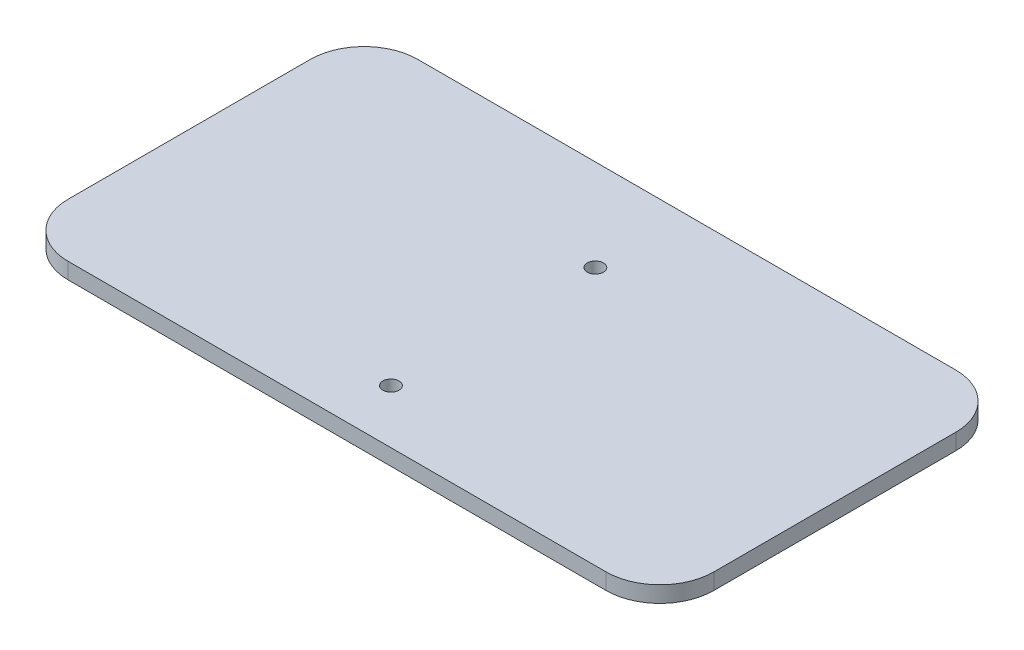
ISO-10303-21;
HEADER;
FILE_DESCRIPTION(('STEP AP214'),'2;1');
FILE_NAME('part.step','',(''),(''),'','','');
FILE_SCHEMA(('AUTOMOTIVE_DESIGN { 1 0 10303 214 1 1 1 1 }'));
ENDSEC;
DATA;
#1=APPLICATION_CONTEXT('core data for automotive mechanical design processes');
#2=APPLICATION_PROTOCOL_DEFINITION('international standard','automotive_design',2000,#1);
#3=PRODUCT_CONTEXT('',#1,'mechanical');
#4=PRODUCT('Part','Part','',(#3));
#5=PRODUCT_RELATED_PRODUCT_CATEGORY('part','',(#4));
#6=PRODUCT_DEFINITION_FORMATION('','',#4);
#7=PRODUCT_DEFINITION_CONTEXT('part definition',#1,'design');
#8=PRODUCT_DEFINITION('design','',#6,#7);
#9=PRODUCT_DEFINITION_SHAPE('','',#8);
#10=(LENGTH_UNIT() NAMED_UNIT(*) SI_UNIT(.MILLI.,.METRE.));
#11=(NAMED_UNIT(*) PLANE_ANGLE_UNIT() SI_UNIT($,.RADIAN.));
#12=(NAMED_UNIT(*) SI_UNIT($,.STERADIAN.) SOLID_ANGLE_UNIT());
#13=UNCERTAINTY_MEASURE_WITH_UNIT(LENGTH_MEASURE(1.E-05),#10,'distance_accuracy_value','');
#14=(GEOMETRIC_REPRESENTATION_CONTEXT(3) GLOBAL_UNCERTAINTY_ASSIGNED_CONTEXT((#13)) GLOBAL_UNIT_ASSIGNED_CONTEXT((#10,
#11,#12)) REPRESENTATION_CONTEXT('',''));
#15=CARTESIAN_POINT('',(0.,0.,0.));
#16=DIRECTION('',(0.,0.,1.));
#17=DIRECTION('',(1.,0.,0.));
#18=AXIS2_PLACEMENT_3D('',#15,#16,#17);
#19=CARTESIAN_POINT('',(-50.,3.,-45.));
#20=DIRECTION('',(0.,-1.,0.));
#21=DIRECTION('',(0.,0.,-1.));
#22=AXIS2_PLACEMENT_3D('',#19,#20,#21);
#23=PLANE('',#22);
#24=CARTESIAN_POINT('',(-50.,3.,-45.));
#25=DIRECTION('',(0.,1.,0.));
#26=DIRECTION('',(0.,0.,-1.));
#27=AXIS2_PLACEMENT_3D('',#24,#25,#26);
#28=CIRCLE('',#27,10.);
#29=CARTESIAN_POINT('',(-50.,3.,-55.));
#30=VERTEX_POINT('',#29);
#31=CARTESIAN_POINT('',(-60.,3.,-45.));
#32=VERTEX_POINT('',#31);
#33=EDGE_CURVE('E145',#30,#32,#28,.T.);
#34=ORIENTED_EDGE('',*,*,#33,.T.);
#35=DIRECTION('',(0.,0.,1.));
#36=VECTOR('',#35,1.);
#37=CARTESIAN_POINT('',(-60.,3.,0.));
#38=LINE('',#37,#36);
#39=CARTESIAN_POINT('',(-60.,3.,0.));
#40=VERTEX_POINT('',#39);
#41=EDGE_CURVE('E93',#32,#40,#38,.T.);
#42=ORIENTED_EDGE('',*,*,#41,.T.);
#43=CARTESIAN_POINT('',(-50.,3.,0.));
#44=DIRECTION('',(0.,1.,0.));
#45=DIRECTION('',(0.,0.,-1.));
#46=AXIS2_PLACEMENT_3D('',#43,#44,#45);
#47=CIRCLE('',#46,10.);
#48=CARTESIAN_POINT('',(-49.9999999999999,3.,10.));
#49=VERTEX_POINT('',#48);
#50=EDGE_CURVE('E160',#40,#49,#47,.T.);
#51=ORIENTED_EDGE('',*,*,#50,.T.);
#52=DIRECTION('',(1.,0.,0.));
#53=VECTOR('',#52,1.);
#54=CARTESIAN_POINT('',(-49.9999999999999,3.,10.));
#55=LINE('',#54,#53);
#56=CARTESIAN_POINT('',(49.9999999999999,3.,10.));
#57=VERTEX_POINT('',#56);
#58=EDGE_CURVE('E173',#49,#57,#55,.T.);
#59=ORIENTED_EDGE('',*,*,#58,.T.);
#60=CARTESIAN_POINT('',(50.,3.,0.));
#61=DIRECTION('',(0.,1.,0.));
#62=DIRECTION('',(0.,0.,1.));
#63=AXIS2_PLACEMENT_3D('',#60,#61,#62);
#64=CIRCLE('',#63,10.);
#65=CARTESIAN_POINT('',(60.,3.,0.));
#66=VERTEX_POINT('',#65);
#67=EDGE_CURVE('E112',#57,#66,#64,.T.);
#68=ORIENTED_EDGE('',*,*,#67,.T.);
#69=DIRECTION('',(0.,0.,-1.));
#70=VECTOR('',#69,1.);
#71=CARTESIAN_POINT('',(60.,3.,0.));
#72=LINE('',#71,#70);
#73=CARTESIAN_POINT('',(60.,3.,-45.));
#74=VERTEX_POINT('',#73);
#75=EDGE_CURVE('E106',#66,#74,#72,.T.);
#76=ORIENTED_EDGE('',*,*,#75,.T.);
#77=CARTESIAN_POINT('',(50.,3.,-45.));
#78=DIRECTION('',(0.,1.,0.));
#79=DIRECTION('',(0.,0.,-1.));
#80=AXIS2_PLACEMENT_3D('',#77,#78,#79);
#81=CIRCLE('',#80,10.);
#82=CARTESIAN_POINT('',(50.,3.,-55.));
#83=VERTEX_POINT('',#82);
#84=EDGE_CURVE('E110',#74,#83,#81,.T.);
#85=ORIENTED_EDGE('',*,*,#84,.T.);
#86=DIRECTION('',(-1.,0.,0.));
#87=VECTOR('',#86,1.);
#88=CARTESIAN_POINT('',(-50.,3.,-55.));
#89=LINE('',#88,#87);
#90=EDGE_CURVE('E50',#83,#30,#89,.T.);
#91=ORIENTED_EDGE('',*,*,#90,.T.);
#92=EDGE_LOOP('',(#34,#42,#51,#59,#68,#76,#85,#91));
#93=FACE_BOUND('',#92,.T.);
#94=CARTESIAN_POINT('',(0.,3.,0.));
#95=DIRECTION('',(0.,1.,0.));
#96=DIRECTION('',(0.,0.,1.));
#97=AXIS2_PLACEMENT_3D('',#94,#95,#96);
#98=CIRCLE('',#97,1.5);
#99=CARTESIAN_POINT('',(0.,3.,1.5));
#100=VERTEX_POINT('',#99);
#101=EDGE_CURVE('E134',#100,#100,#98,.T.);
#102=ORIENTED_EDGE('',*,*,#101,.F.);
#103=EDGE_LOOP('',(#102));
#104=FACE_BOUND('',#103,.T.);
#105=CARTESIAN_POINT('',(0.,3.,-38.));
#106=DIRECTION('',(0.,1.,0.));
#107=DIRECTION('',(0.,0.,1.));
#108=AXIS2_PLACEMENT_3D('',#105,#106,#107);
#109=CIRCLE('',#108,1.5);
#110=CARTESIAN_POINT('',(0.,3.,-36.5));
#111=VERTEX_POINT('',#110);
#112=EDGE_CURVE('E182',#111,#111,#109,.T.);
#113=ORIENTED_EDGE('',*,*,#112,.F.);
#114=EDGE_LOOP('',(#113));
#115=FACE_BOUND('',#114,.T.);
#116=ADVANCED_FACE('F33',(#93,#104,#115),#23,.F.);
#117=CARTESIAN_POINT('',(-50.,0.,-45.));
#118=DIRECTION('',(0.,-1.,0.));
#119=DIRECTION('',(0.,0.,-1.));
#120=AXIS2_PLACEMENT_3D('',#117,#118,#119);
#121=PLANE('',#120);
#122=CARTESIAN_POINT('',(0.,0.,0.));
#123=DIRECTION('',(0.,1.,0.));
#124=DIRECTION('',(0.,0.,1.));
#125=AXIS2_PLACEMENT_3D('',#122,#123,#124);
#126=CIRCLE('',#125,1.5);
#127=CARTESIAN_POINT('',(0.,0.,1.5));
#128=VERTEX_POINT('',#127);
#129=EDGE_CURVE('E179',#128,#128,#126,.T.);
#130=ORIENTED_EDGE('',*,*,#129,.T.);
#131=EDGE_LOOP('',(#130));
#132=FACE_BOUND('',#131,.T.);
#133=CARTESIAN_POINT('',(-50.,0.,-45.));
#134=DIRECTION('',(0.,1.,0.));
#135=DIRECTION('',(0.,0.,-1.));
#136=AXIS2_PLACEMENT_3D('',#133,#134,#135);
#137=CIRCLE('',#136,10.);
#138=CARTESIAN_POINT('',(-50.,0.,-55.));
#139=VERTEX_POINT('',#138);
#140=CARTESIAN_POINT('',(-60.,0.,-45.));
#141=VERTEX_POINT('',#140);
#142=EDGE_CURVE('E130',#139,#141,#137,.T.);
#143=ORIENTED_EDGE('',*,*,#142,.F.);
#144=DIRECTION('',(-1.,0.,0.));
#145=VECTOR('',#144,1.);
#146=CARTESIAN_POINT('',(-50.,0.,-55.));
#147=LINE('',#146,#145);
#148=CARTESIAN_POINT('',(50.,0.,-55.));
#149=VERTEX_POINT('',#148);
#150=EDGE_CURVE('E85',#149,#139,#147,.T.);
#151=ORIENTED_EDGE('',*,*,#150,.F.);
#152=CARTESIAN_POINT('',(50.,0.,-45.));
#153=DIRECTION('',(0.,1.,0.));
#154=DIRECTION('',(0.,0.,-1.));
#155=AXIS2_PLACEMENT_3D('',#152,#153,#154);
#156=CIRCLE('',#155,10.);
#157=CARTESIAN_POINT('',(60.,0.,-45.));
#158=VERTEX_POINT('',#157);
#159=EDGE_CURVE('E79',#158,#149,#156,.T.);
#160=ORIENTED_EDGE('',*,*,#159,.F.);
#161=DIRECTION('',(0.,0.,-1.));
#162=VECTOR('',#161,1.);
#163=CARTESIAN_POINT('',(60.,0.,0.));
#164=LINE('',#163,#162);
#165=CARTESIAN_POINT('',(60.,0.,0.));
#166=VERTEX_POINT('',#165);
#167=EDGE_CURVE('E120',#166,#158,#164,.T.);
#168=ORIENTED_EDGE('',*,*,#167,.F.);
#169=CARTESIAN_POINT('',(50.,0.,0.));
#170=DIRECTION('',(0.,1.,0.));
#171=DIRECTION('',(0.,0.,1.));
#172=AXIS2_PLACEMENT_3D('',#169,#170,#171);
#173=CIRCLE('',#172,10.);
#174=CARTESIAN_POINT('',(49.9999999999999,0.,10.));
#175=VERTEX_POINT('',#174);
#176=EDGE_CURVE('E140',#175,#166,#173,.T.);
#177=ORIENTED_EDGE('',*,*,#176,.F.);
#178=DIRECTION('',(1.,0.,0.));
#179=VECTOR('',#178,1.);
#180=CARTESIAN_POINT('',(-49.9999999999999,0.,10.));
#181=LINE('',#180,#179);
#182=CARTESIAN_POINT('',(-49.9999999999999,0.,10.));
#183=VERTEX_POINT('',#182);
#184=EDGE_CURVE('E138',#183,#175,#181,.T.);
#185=ORIENTED_EDGE('',*,*,#184,.F.);
#186=CARTESIAN_POINT('',(-50.,0.,0.));
#187=DIRECTION('',(0.,1.,0.));
#188=DIRECTION('',(0.,0.,-1.));
#189=AXIS2_PLACEMENT_3D('',#186,#187,#188);
#190=CIRCLE('',#189,10.);
#191=CARTESIAN_POINT('',(-60.,0.,0.));
#192=VERTEX_POINT('',#191);
#193=EDGE_CURVE('E136',#192,#183,#190,.T.);
#194=ORIENTED_EDGE('',*,*,#193,.F.);
#195=DIRECTION('',(0.,0.,1.));
#196=VECTOR('',#195,1.);
#197=CARTESIAN_POINT('',(-60.,0.,0.));
#198=LINE('',#197,#196);
#199=EDGE_CURVE('E133',#141,#192,#198,.T.);
#200=ORIENTED_EDGE('',*,*,#199,.F.);
#201=EDGE_LOOP('',(#143,#151,#160,#168,#177,#185,#194,#200));
#202=FACE_BOUND('',#201,.T.);
#203=CARTESIAN_POINT('',(0.,0.,-38.));
#204=DIRECTION('',(0.,1.,0.));
#205=DIRECTION('',(0.,0.,1.));
#206=AXIS2_PLACEMENT_3D('',#203,#204,#205);
#207=CIRCLE('',#206,1.5);
#208=CARTESIAN_POINT('',(0.,0.,-36.5));
#209=VERTEX_POINT('',#208);
#210=EDGE_CURVE('E185',#209,#209,#207,.T.);
#211=ORIENTED_EDGE('',*,*,#210,.T.);
#212=EDGE_LOOP('',(#211));
#213=FACE_BOUND('',#212,.T.);
#214=ADVANCED_FACE('F164',(#132,#202,#213),#121,.T.);
#215=CARTESIAN_POINT('',(-50.,3.,-45.));
#216=DIRECTION('',(0.,-1.,0.));
#217=DIRECTION('',(0.,0.,-1.));
#218=AXIS2_PLACEMENT_3D('',#215,#216,#217);
#219=CYLINDRICAL_SURFACE('',#218,10.);
#220=ORIENTED_EDGE('',*,*,#142,.T.);
#221=DIRECTION('',(0.,-1.,0.));
#222=VECTOR('',#221,1.);
#223=CARTESIAN_POINT('',(-60.,3.,-45.));
#224=LINE('',#223,#222);
#225=EDGE_CURVE('E11',#32,#141,#224,.T.);
#226=ORIENTED_EDGE('',*,*,#225,.F.);
#227=ORIENTED_EDGE('',*,*,#33,.F.);
#228=DIRECTION('',(0.,-1.,0.));
#229=VECTOR('',#228,1.);
#230=CARTESIAN_POINT('',(-50.,3.,-55.));
#231=LINE('',#230,#229);
#232=EDGE_CURVE('E126',#30,#139,#231,.T.);
#233=ORIENTED_EDGE('',*,*,#232,.T.);
#234=EDGE_LOOP('',(#220,#226,#227,#233));
#235=FACE_BOUND('',#234,.T.);
#236=ADVANCED_FACE('F35',(#235),#219,.T.);
#237=CARTESIAN_POINT('',(-60.,3.,0.));
#238=DIRECTION('',(1.,0.,0.));
#239=DIRECTION('',(0.,0.,-1.));
#240=AXIS2_PLACEMENT_3D('',#237,#238,#239);
#241=PLANE('',#240);
#242=ORIENTED_EDGE('',*,*,#199,.T.);
#243=DIRECTION('',(0.,-1.,0.));
#244=VECTOR('',#243,1.);
#245=CARTESIAN_POINT('',(-60.,3.,0.));
#246=LINE('',#245,#244);
#247=EDGE_CURVE('E42',#40,#192,#246,.T.);
#248=ORIENTED_EDGE('',*,*,#247,.F.);
#249=ORIENTED_EDGE('',*,*,#41,.F.);
#250=ORIENTED_EDGE('',*,*,#225,.T.);
#251=EDGE_LOOP('',(#242,#248,#249,#250));
#252=FACE_BOUND('',#251,.T.);
#253=ADVANCED_FACE('F217',(#252),#241,.F.);
#254=CARTESIAN_POINT('',(-50.,3.,0.));
#255=DIRECTION('',(0.,-1.,0.));
#256=DIRECTION('',(0.,0.,-1.));
#257=AXIS2_PLACEMENT_3D('',#254,#255,#256);
#258=CYLINDRICAL_SURFACE('',#257,10.);
#259=ORIENTED_EDGE('',*,*,#193,.T.);
#260=DIRECTION('',(0.,-1.,0.));
#261=VECTOR('',#260,1.);
#262=CARTESIAN_POINT('',(-49.9999999999999,3.,10.));
#263=LINE('',#262,#261);
#264=EDGE_CURVE('E152',#49,#183,#263,.T.);
#265=ORIENTED_EDGE('',*,*,#264,.F.);
#266=ORIENTED_EDGE('',*,*,#50,.F.);
#267=ORIENTED_EDGE('',*,*,#247,.T.);
#268=EDGE_LOOP('',(#259,#265,#266,#267));
#269=FACE_BOUND('',#268,.T.);
#270=ADVANCED_FACE('F158',(#269),#258,.T.);
#271=CARTESIAN_POINT('',(-49.9999999999999,3.,10.));
#272=DIRECTION('',(0.,0.,-1.));
#273=DIRECTION('',(-1.,0.,0.));
#274=AXIS2_PLACEMENT_3D('',#271,#272,#273);
#275=PLANE('',#274);
#276=ORIENTED_EDGE('',*,*,#184,.T.);
#277=DIRECTION('',(0.,-1.,0.));
#278=VECTOR('',#277,1.);
#279=CARTESIAN_POINT('',(49.9999999999999,3.,10.));
#280=LINE('',#279,#278);
#281=EDGE_CURVE('E149',#57,#175,#280,.T.);
#282=ORIENTED_EDGE('',*,*,#281,.F.);
#283=ORIENTED_EDGE('',*,*,#58,.F.);
#284=ORIENTED_EDGE('',*,*,#264,.T.);
#285=EDGE_LOOP('',(#276,#282,#283,#284));
#286=FACE_BOUND('',#285,.T.);
#287=ADVANCED_FACE('F169',(#286),#275,.F.);
#288=CARTESIAN_POINT('',(50.,3.,0.));
#289=DIRECTION('',(0.,-1.,0.));
#290=DIRECTION('',(0.,0.,-1.));
#291=AXIS2_PLACEMENT_3D('',#288,#289,#290);
#292=CYLINDRICAL_SURFACE('',#291,10.);
#293=ORIENTED_EDGE('',*,*,#176,.T.);
#294=DIRECTION('',(0.,-1.,0.));
#295=VECTOR('',#294,1.);
#296=CARTESIAN_POINT('',(60.,3.,0.));
#297=LINE('',#296,#295);
#298=EDGE_CURVE('E121',#66,#166,#297,.T.);
#299=ORIENTED_EDGE('',*,*,#298,.F.);
#300=ORIENTED_EDGE('',*,*,#67,.F.);
#301=ORIENTED_EDGE('',*,*,#281,.T.);
#302=EDGE_LOOP('',(#293,#299,#300,#301));
#303=FACE_BOUND('',#302,.T.);
#304=ADVANCED_FACE('F172',(#303),#292,.T.);
#305=CARTESIAN_POINT('',(60.,3.,0.));
#306=DIRECTION('',(-1.,0.,0.));
#307=DIRECTION('',(0.,0.,1.));
#308=AXIS2_PLACEMENT_3D('',#305,#306,#307);
#309=PLANE('',#308);
#310=ORIENTED_EDGE('',*,*,#167,.T.);
#311=DIRECTION('',(0.,-1.,0.));
#312=VECTOR('',#311,1.);
#313=CARTESIAN_POINT('',(60.,3.,-45.));
#314=LINE('',#313,#312);
#315=EDGE_CURVE('E117',#74,#158,#314,.T.);
#316=ORIENTED_EDGE('',*,*,#315,.F.);
#317=ORIENTED_EDGE('',*,*,#75,.F.);
#318=ORIENTED_EDGE('',*,*,#298,.T.);
#319=EDGE_LOOP('',(#310,#316,#317,#318));
#320=FACE_BOUND('',#319,.T.);
#321=ADVANCED_FACE('F118',(#320),#309,.F.);
#322=CARTESIAN_POINT('',(50.,3.,-45.));
#323=DIRECTION('',(0.,-1.,0.));
#324=DIRECTION('',(0.,0.,-1.));
#325=AXIS2_PLACEMENT_3D('',#322,#323,#324);
#326=CYLINDRICAL_SURFACE('',#325,10.);
#327=ORIENTED_EDGE('',*,*,#159,.T.);
#328=DIRECTION('',(0.,-1.,0.));
#329=VECTOR('',#328,1.);
#330=CARTESIAN_POINT('',(50.,3.,-55.));
#331=LINE('',#330,#329);
#332=EDGE_CURVE('E122',#83,#149,#331,.T.);
#333=ORIENTED_EDGE('',*,*,#332,.F.);
#334=ORIENTED_EDGE('',*,*,#84,.F.);
#335=ORIENTED_EDGE('',*,*,#315,.T.);
#336=EDGE_LOOP('',(#327,#333,#334,#335));
#337=FACE_BOUND('',#336,.T.);
#338=ADVANCED_FACE('F124',(#337),#326,.T.);
#339=CARTESIAN_POINT('',(-50.,3.,-55.));
#340=DIRECTION('',(0.,0.,1.));
#341=DIRECTION('',(1.,0.,0.));
#342=AXIS2_PLACEMENT_3D('',#339,#340,#341);
#343=PLANE('',#342);
#344=ORIENTED_EDGE('',*,*,#150,.T.);
#345=ORIENTED_EDGE('',*,*,#232,.F.);
#346=ORIENTED_EDGE('',*,*,#90,.F.);
#347=ORIENTED_EDGE('',*,*,#332,.T.);
#348=EDGE_LOOP('',(#344,#345,#346,#347));
#349=FACE_BOUND('',#348,.T.);
#350=ADVANCED_FACE('F205',(#349),#343,.F.);
#351=CARTESIAN_POINT('',(0.,3.,0.));
#352=DIRECTION('',(0.,-1.,0.));
#353=DIRECTION('',(0.,0.,-1.));
#354=AXIS2_PLACEMENT_3D('',#351,#352,#353);
#355=CYLINDRICAL_SURFACE('',#354,1.5);
#356=ORIENTED_EDGE('',*,*,#101,.T.);
#357=EDGE_LOOP('',(#356));
#358=FACE_BOUND('',#357,.T.);
#359=ORIENTED_EDGE('',*,*,#129,.F.);
#360=EDGE_LOOP('',(#359));
#361=FACE_BOUND('',#360,.T.);
#362=ADVANCED_FACE('F202',(#358,#361),#355,.F.);
#363=CARTESIAN_POINT('',(0.,3.,-38.));
#364=DIRECTION('',(0.,-1.,0.));
#365=DIRECTION('',(0.,0.,-1.));
#366=AXIS2_PLACEMENT_3D('',#363,#364,#365);
#367=CYLINDRICAL_SURFACE('',#366,1.5);
#368=ORIENTED_EDGE('',*,*,#112,.T.);
#369=EDGE_LOOP('',(#368));
#370=FACE_BOUND('',#369,.T.);
#371=ORIENTED_EDGE('',*,*,#210,.F.);
#372=EDGE_LOOP('',(#371));
#373=FACE_BOUND('',#372,.T.);
#374=ADVANCED_FACE('F191',(#370,#373),#367,.F.);
#375=CLOSED_SHELL('',(#116,#214,#236,#253,#270,#287,#304,#321,#338,#350,#362,#374));
#376=MANIFOLD_SOLID_BREP('B2',#375);
#377=ADVANCED_BREP_SHAPE_REPRESENTATION('',(#18,#376),#14);
#378=SHAPE_DEFINITION_REPRESENTATION(#9,#377);
ENDSEC;
END-ISO-10303-21;
